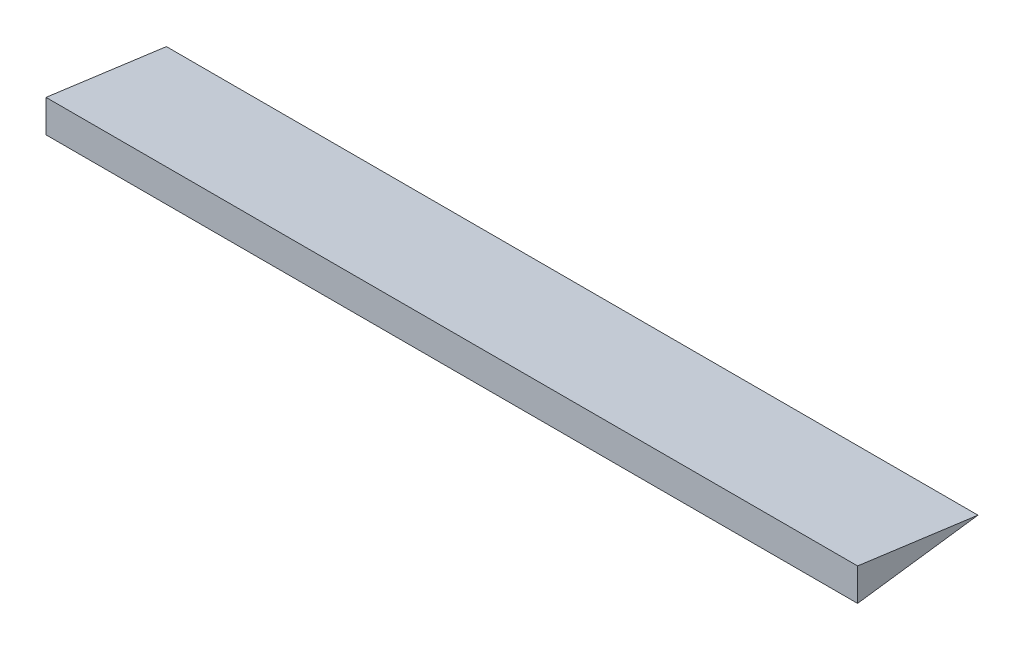
ISO-10303-21;
HEADER;
FILE_DESCRIPTION(('STEP AP214'),'2;1');
FILE_NAME('part.step','',(''),(''),'','','');
FILE_SCHEMA(('AUTOMOTIVE_DESIGN { 1 0 10303 214 1 1 1 1 }'));
ENDSEC;
DATA;
#1=APPLICATION_CONTEXT('core data for automotive mechanical design processes');
#2=APPLICATION_PROTOCOL_DEFINITION('international standard','automotive_design',2000,#1);
#3=PRODUCT_CONTEXT('',#1,'mechanical');
#4=PRODUCT('Part','Part','',(#3));
#5=PRODUCT_RELATED_PRODUCT_CATEGORY('part','',(#4));
#6=PRODUCT_DEFINITION_FORMATION('','',#4);
#7=PRODUCT_DEFINITION_CONTEXT('part definition',#1,'design');
#8=PRODUCT_DEFINITION('design','',#6,#7);
#9=PRODUCT_DEFINITION_SHAPE('','',#8);
#10=(LENGTH_UNIT() NAMED_UNIT(*) SI_UNIT(.MILLI.,.METRE.));
#11=(NAMED_UNIT(*) PLANE_ANGLE_UNIT() SI_UNIT($,.RADIAN.));
#12=(NAMED_UNIT(*) SI_UNIT($,.STERADIAN.) SOLID_ANGLE_UNIT());
#13=UNCERTAINTY_MEASURE_WITH_UNIT(LENGTH_MEASURE(1.E-05),#10,'distance_accuracy_value','');
#14=(GEOMETRIC_REPRESENTATION_CONTEXT(3) GLOBAL_UNCERTAINTY_ASSIGNED_CONTEXT((#13)) GLOBAL_UNIT_ASSIGNED_CONTEXT((#10,
#11,#12)) REPRESENTATION_CONTEXT('',''));
#15=CARTESIAN_POINT('',(0.,0.,0.));
#16=DIRECTION('',(0.,0.,1.));
#17=DIRECTION('',(1.,0.,0.));
#18=AXIS2_PLACEMENT_3D('',#15,#16,#17);
#19=CARTESIAN_POINT('',(168.5,-6.73883674272304,50.));
#20=DIRECTION('',(0.,0.991039506706489,0.133569068825676));
#21=DIRECTION('',(0.,-0.133569068825676,0.991039506706489));
#22=AXIS2_PLACEMENT_3D('',#19,#20,#21);
#23=PLANE('',#22);
#24=DIRECTION('',(0.,0.133569068825676,-0.991039506706489));
#25=VECTOR('',#24,1.);
#26=CARTESIAN_POINT('',(-168.5,-6.73883674272304,50.));
#27=LINE('',#26,#25);
#28=CARTESIAN_POINT('',(-168.5,-6.73883674272304,50.));
#29=VERTEX_POINT('',#28);
#30=CARTESIAN_POINT('',(-168.5,0.,0.));
#31=VERTEX_POINT('',#30);
#32=EDGE_CURVE('E84',#29,#31,#27,.T.);
#33=ORIENTED_EDGE('',*,*,#32,.T.);
#34=DIRECTION('',(-1.,0.,0.));
#35=VECTOR('',#34,1.);
#36=CARTESIAN_POINT('',(168.5,0.,0.));
#37=LINE('',#36,#35);
#38=CARTESIAN_POINT('',(168.5,0.,0.));
#39=VERTEX_POINT('',#38);
#40=EDGE_CURVE('E11',#39,#31,#37,.T.);
#41=ORIENTED_EDGE('',*,*,#40,.F.);
#42=DIRECTION('',(0.,0.133569068825676,-0.991039506706489));
#43=VECTOR('',#42,1.);
#44=CARTESIAN_POINT('',(168.5,-6.73883674272304,50.));
#45=LINE('',#44,#43);
#46=CARTESIAN_POINT('',(168.5,-6.73883674272304,50.));
#47=VERTEX_POINT('',#46);
#48=EDGE_CURVE('E77',#47,#39,#45,.T.);
#49=ORIENTED_EDGE('',*,*,#48,.F.);
#50=DIRECTION('',(-1.,0.,0.));
#51=VECTOR('',#50,1.);
#52=CARTESIAN_POINT('',(168.5,-6.73883674272304,50.));
#53=LINE('',#52,#51);
#54=EDGE_CURVE('E85',#47,#29,#53,.T.);
#55=ORIENTED_EDGE('',*,*,#54,.T.);
#56=EDGE_LOOP('',(#33,#41,#49,#55));
#57=FACE_BOUND('',#56,.T.);
#58=ADVANCED_FACE('F37',(#57),#23,.F.);
#59=CARTESIAN_POINT('',(168.5,6.73883674272304,50.));
#60=DIRECTION('',(0.,-0.991039506706489,0.133569068825676));
#61=DIRECTION('',(0.,-0.133569068825676,-0.991039506706489));
#62=AXIS2_PLACEMENT_3D('',#59,#60,#61);
#63=PLANE('',#62);
#64=DIRECTION('',(0.,0.133569068825676,0.991039506706489));
#65=VECTOR('',#64,1.);
#66=CARTESIAN_POINT('',(-168.5,6.73883674272304,50.));
#67=LINE('',#66,#65);
#68=CARTESIAN_POINT('',(-168.5,6.73883674272304,50.));
#69=VERTEX_POINT('',#68);
#70=EDGE_CURVE('E65',#31,#69,#67,.T.);
#71=ORIENTED_EDGE('',*,*,#70,.T.);
#72=DIRECTION('',(-1.,0.,0.));
#73=VECTOR('',#72,1.);
#74=CARTESIAN_POINT('',(168.5,6.73883674272304,50.));
#75=LINE('',#74,#73);
#76=CARTESIAN_POINT('',(168.5,6.73883674272304,50.));
#77=VERTEX_POINT('',#76);
#78=EDGE_CURVE('E45',#77,#69,#75,.T.);
#79=ORIENTED_EDGE('',*,*,#78,.F.);
#80=DIRECTION('',(0.,0.133569068825676,0.991039506706489));
#81=VECTOR('',#80,1.);
#82=CARTESIAN_POINT('',(168.5,6.73883674272304,50.));
#83=LINE('',#82,#81);
#84=EDGE_CURVE('E73',#39,#77,#83,.T.);
#85=ORIENTED_EDGE('',*,*,#84,.F.);
#86=ORIENTED_EDGE('',*,*,#40,.T.);
#87=EDGE_LOOP('',(#71,#79,#85,#86));
#88=FACE_BOUND('',#87,.T.);
#89=ADVANCED_FACE('F74',(#88),#63,.F.);
#90=CARTESIAN_POINT('',(168.5,-6.73883674272304,50.));
#91=DIRECTION('',(0.,0.,-1.));
#92=DIRECTION('',(-1.,0.,0.));
#93=AXIS2_PLACEMENT_3D('',#90,#91,#92);
#94=PLANE('',#93);
#95=DIRECTION('',(0.,-1.,0.));
#96=VECTOR('',#95,1.);
#97=CARTESIAN_POINT('',(-168.5,-6.73883674272304,50.));
#98=LINE('',#97,#96);
#99=EDGE_CURVE('E70',#69,#29,#98,.T.);
#100=ORIENTED_EDGE('',*,*,#99,.T.);
#101=ORIENTED_EDGE('',*,*,#54,.F.);
#102=DIRECTION('',(0.,-1.,0.));
#103=VECTOR('',#102,1.);
#104=CARTESIAN_POINT('',(168.5,-6.73883674272304,50.));
#105=LINE('',#104,#103);
#106=EDGE_CURVE('E53',#77,#47,#105,.T.);
#107=ORIENTED_EDGE('',*,*,#106,.F.);
#108=ORIENTED_EDGE('',*,*,#78,.T.);
#109=EDGE_LOOP('',(#100,#101,#107,#108));
#110=FACE_BOUND('',#109,.T.);
#111=ADVANCED_FACE('F92',(#110),#94,.F.);
#112=CARTESIAN_POINT('',(168.5,0.,0.));
#113=DIRECTION('',(1.,0.,0.));
#114=DIRECTION('',(0.,0.,-1.));
#115=AXIS2_PLACEMENT_3D('',#112,#113,#114);
#116=PLANE('',#115);
#117=ORIENTED_EDGE('',*,*,#48,.T.);
#118=ORIENTED_EDGE('',*,*,#84,.T.);
#119=ORIENTED_EDGE('',*,*,#106,.T.);
#120=EDGE_LOOP('',(#117,#118,#119));
#121=FACE_BOUND('',#120,.T.);
#122=ADVANCED_FACE('F80',(#121),#116,.T.);
#123=CARTESIAN_POINT('',(-168.5,0.,0.));
#124=DIRECTION('',(1.,0.,0.));
#125=DIRECTION('',(0.,0.,-1.));
#126=AXIS2_PLACEMENT_3D('',#123,#124,#125);
#127=PLANE('',#126);
#128=ORIENTED_EDGE('',*,*,#32,.F.);
#129=ORIENTED_EDGE('',*,*,#99,.F.);
#130=ORIENTED_EDGE('',*,*,#70,.F.);
#131=EDGE_LOOP('',(#128,#129,#130));
#132=FACE_BOUND('',#131,.T.);
#133=ADVANCED_FACE('F93',(#132),#127,.F.);
#134=CLOSED_SHELL('',(#58,#89,#111,#122,#133));
#135=MANIFOLD_SOLID_BREP('B2',#134);
#136=ADVANCED_BREP_SHAPE_REPRESENTATION('',(#18,#135),#14);
#137=SHAPE_DEFINITION_REPRESENTATION(#9,#136);
ENDSEC;
END-ISO-10303-21;
